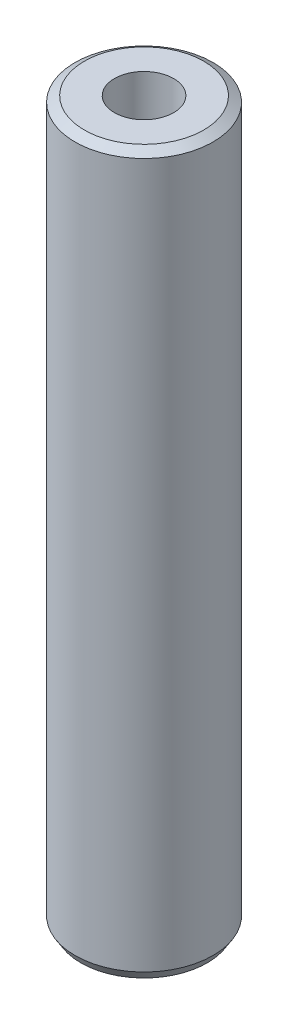
ISO-10303-21;
HEADER;
FILE_DESCRIPTION(('STEP AP214'),'2;1');
FILE_NAME('part.step','',(''),(''),'','','');
FILE_SCHEMA(('AUTOMOTIVE_DESIGN { 1 0 10303 214 1 1 1 1 }'));
ENDSEC;
DATA;
#1=APPLICATION_CONTEXT('core data for automotive mechanical design processes');
#2=APPLICATION_PROTOCOL_DEFINITION('international standard','automotive_design',2000,#1);
#3=PRODUCT_CONTEXT('',#1,'mechanical');
#4=PRODUCT('Part','Part','',(#3));
#5=PRODUCT_RELATED_PRODUCT_CATEGORY('part','',(#4));
#6=PRODUCT_DEFINITION_FORMATION('','',#4);
#7=PRODUCT_DEFINITION_CONTEXT('part definition',#1,'design');
#8=PRODUCT_DEFINITION('design','',#6,#7);
#9=PRODUCT_DEFINITION_SHAPE('','',#8);
#10=(LENGTH_UNIT() NAMED_UNIT(*) SI_UNIT(.MILLI.,.METRE.));
#11=(NAMED_UNIT(*) PLANE_ANGLE_UNIT() SI_UNIT($,.RADIAN.));
#12=(NAMED_UNIT(*) SI_UNIT($,.STERADIAN.) SOLID_ANGLE_UNIT());
#13=UNCERTAINTY_MEASURE_WITH_UNIT(LENGTH_MEASURE(1.E-05),#10,'distance_accuracy_value','');
#14=(GEOMETRIC_REPRESENTATION_CONTEXT(3) GLOBAL_UNCERTAINTY_ASSIGNED_CONTEXT((#13)) GLOBAL_UNIT_ASSIGNED_CONTEXT((#10,
#11,#12)) REPRESENTATION_CONTEXT('',''));
#15=CARTESIAN_POINT('',(0.,0.,0.));
#16=DIRECTION('',(0.,0.,1.));
#17=DIRECTION('',(1.,0.,0.));
#18=AXIS2_PLACEMENT_3D('',#15,#16,#17);
#19=CARTESIAN_POINT('',(0.,600.,0.));
#20=DIRECTION('',(0.,-1.,0.));
#21=DIRECTION('',(0.,0.,-1.));
#22=AXIS2_PLACEMENT_3D('',#19,#20,#21);
#23=CYLINDRICAL_SURFACE('',#22,57.5);
#24=CARTESIAN_POINT('',(0.,595.210824169814,0.));
#25=DIRECTION('',(0.,1.,0.));
#26=DIRECTION('',(0.,0.,1.));
#27=AXIS2_PLACEMENT_3D('',#24,#25,#26);
#28=CIRCLE('',#27,57.5);
#29=CARTESIAN_POINT('',(0.,595.210824169814,-57.5000000000001));
#30=VERTEX_POINT('',#29);
#31=EDGE_CURVE('E50',#30,#30,#28,.F.);
#32=ORIENTED_EDGE('',*,*,#31,.T.);
#33=EDGE_LOOP('',(#32));
#34=FACE_BOUND('',#33,.T.);
#35=CARTESIAN_POINT('',(0.,7.72489831246326,0.));
#36=DIRECTION('',(0.,1.,0.));
#37=DIRECTION('',(0.,0.,1.));
#38=AXIS2_PLACEMENT_3D('',#35,#36,#37);
#39=CIRCLE('',#38,57.5);
#40=CARTESIAN_POINT('',(0.,7.72489831246326,57.5));
#41=VERTEX_POINT('',#40);
#42=EDGE_CURVE('E51',#41,#41,#39,.T.);
#43=ORIENTED_EDGE('',*,*,#42,.T.);
#44=EDGE_LOOP('',(#43));
#45=FACE_BOUND('',#44,.T.);
#46=ADVANCED_FACE('F39',(#34,#45),#23,.T.);
#47=CARTESIAN_POINT('',(0.,600.,0.));
#48=DIRECTION('',(0.,1.,0.));
#49=DIRECTION('',(0.,0.,1.));
#50=AXIS2_PLACEMENT_3D('',#47,#48,#49);
#51=PLANE('',#50);
#52=CARTESIAN_POINT('',(0.,600.,0.));
#53=DIRECTION('',(0.,1.,0.));
#54=DIRECTION('',(0.,0.,1.));
#55=AXIS2_PLACEMENT_3D('',#52,#53,#54);
#56=CIRCLE('',#55,49.7751016875367);
#57=CARTESIAN_POINT('',(0.,600.,-49.7751016875368));
#58=VERTEX_POINT('',#57);
#59=EDGE_CURVE('E54',#58,#58,#56,.T.);
#60=ORIENTED_EDGE('',*,*,#59,.T.);
#61=EDGE_LOOP('',(#60));
#62=FACE_BOUND('',#61,.T.);
#63=CARTESIAN_POINT('',(0.,600.,0.));
#64=DIRECTION('',(0.,1.,0.));
#65=DIRECTION('',(0.,0.,1.));
#66=AXIS2_PLACEMENT_3D('',#63,#64,#65);
#67=CIRCLE('',#66,24.6803880786549);
#68=CARTESIAN_POINT('',(0.,600.,24.6803880786549));
#69=VERTEX_POINT('',#68);
#70=EDGE_CURVE('E58',#69,#69,#67,.T.);
#71=ORIENTED_EDGE('',*,*,#70,.F.);
#72=EDGE_LOOP('',(#71));
#73=FACE_BOUND('',#72,.T.);
#74=ADVANCED_FACE('F69',(#62,#73),#51,.T.);
#75=CARTESIAN_POINT('',(0.,0.,0.));
#76=DIRECTION('',(0.,1.,0.));
#77=DIRECTION('',(0.,0.,1.));
#78=AXIS2_PLACEMENT_3D('',#75,#76,#77);
#79=PLANE('',#78);
#80=CARTESIAN_POINT('',(0.,0.,0.));
#81=DIRECTION('',(0.,1.,0.));
#82=DIRECTION('',(0.,0.,1.));
#83=AXIS2_PLACEMENT_3D('',#80,#81,#82);
#84=CIRCLE('',#83,52.7108241698138);
#85=CARTESIAN_POINT('',(0.,0.,52.7108241698138));
#86=VERTEX_POINT('',#85);
#87=EDGE_CURVE('E10',#86,#86,#84,.F.);
#88=ORIENTED_EDGE('',*,*,#87,.T.);
#89=EDGE_LOOP('',(#88));
#90=FACE_BOUND('',#89,.T.);
#91=CARTESIAN_POINT('',(0.,0.,0.));
#92=DIRECTION('',(0.,1.,0.));
#93=DIRECTION('',(0.,0.,1.));
#94=AXIS2_PLACEMENT_3D('',#91,#92,#93);
#95=CIRCLE('',#94,24.6803880786549);
#96=CARTESIAN_POINT('',(0.,0.,24.6803880786549));
#97=VERTEX_POINT('',#96);
#98=EDGE_CURVE('E63',#97,#97,#95,.T.);
#99=ORIENTED_EDGE('',*,*,#98,.T.);
#100=EDGE_LOOP('',(#99));
#101=FACE_BOUND('',#100,.T.);
#102=ADVANCED_FACE('F75',(#90,#101),#79,.F.);
#103=CARTESIAN_POINT('',(0.,600.,0.));
#104=DIRECTION('',(0.,-1.,0.));
#105=DIRECTION('',(0.,0.,-1.));
#106=AXIS2_PLACEMENT_3D('',#103,#104,#105);
#107=CYLINDRICAL_SURFACE('',#106,24.6803880786549);
#108=ORIENTED_EDGE('',*,*,#70,.T.);
#109=EDGE_LOOP('',(#108));
#110=FACE_BOUND('',#109,.T.);
#111=ORIENTED_EDGE('',*,*,#98,.F.);
#112=EDGE_LOOP('',(#111));
#113=FACE_BOUND('',#112,.T.);
#114=ADVANCED_FACE('F70',(#110,#113),#107,.F.);
#115=CARTESIAN_POINT('',(0.,600.,0.));
#116=DIRECTION('',(0.,-1.,0.));
#117=DIRECTION('',(0.,0.,-1.));
#118=AXIS2_PLACEMENT_3D('',#115,#116,#117);
#119=CONICAL_SURFACE('',#118,49.7751016875367,1.01582501679004);
#120=CARTESIAN_POINT('',(0.,595.210824169814,-57.5000000000001));
#121=CARTESIAN_POINT('',(0.,595.260711418045,-57.4195323092453));
#122=CARTESIAN_POINT('',(0.,595.310598666276,-57.3390646184904));
#123=CARTESIAN_POINT('',(0.,595.410373162738,-57.1781292369808));
#124=CARTESIAN_POINT('',(0.,595.460260410969,-57.097661546226));
#125=CARTESIAN_POINT('',(0.,595.560034907431,-56.9367261647163));
#126=CARTESIAN_POINT('',(0.,595.609922155663,-56.8562584739615));
#127=CARTESIAN_POINT('',(0.,595.709696652125,-56.6953230924518));
#128=CARTESIAN_POINT('',(0.,595.759583900356,-56.614855401697));
#129=CARTESIAN_POINT('',(0.,595.859358396818,-56.4539200201874));
#130=CARTESIAN_POINT('',(0.,595.909245645049,-56.3734523294325));
#131=CARTESIAN_POINT('',(0.,596.009020141511,-56.2125169479229));
#132=CARTESIAN_POINT('',(0.,596.058907389743,-56.1320492571681));
#133=CARTESIAN_POINT('',(0.,596.158681886205,-55.9711138756584));
#134=CARTESIAN_POINT('',(0.,596.208569134436,-55.8906461849036));
#135=CARTESIAN_POINT('',(0.,596.308343630898,-55.7297108033939));
#136=CARTESIAN_POINT('',(0.,596.358230879129,-55.6492431126391));
#137=CARTESIAN_POINT('',(0.,596.458005375591,-55.4883077311295));
#138=CARTESIAN_POINT('',(0.,596.507892623822,-55.4078400403746));
#139=CARTESIAN_POINT('',(0.,596.607667120285,-55.246904658865));
#140=CARTESIAN_POINT('',(0.,596.657554368516,-55.1664369681102));
#141=CARTESIAN_POINT('',(0.,596.757328864978,-55.0055015866005));
#142=CARTESIAN_POINT('',(0.,596.807216113209,-54.9250338958457));
#143=CARTESIAN_POINT('',(0.,596.906990609671,-54.764098514336));
#144=CARTESIAN_POINT('',(0.,596.956877857902,-54.6836308235812));
#145=CARTESIAN_POINT('',(0.,597.056652354365,-54.5226954420716));
#146=CARTESIAN_POINT('',(0.,597.106539602596,-54.4422277513167));
#147=CARTESIAN_POINT('',(0.,597.206314099058,-54.2812923698071));
#148=CARTESIAN_POINT('',(0.,597.256201347289,-54.2008246790522));
#149=CARTESIAN_POINT('',(0.,597.355975843751,-54.0398892975426));
#150=CARTESIAN_POINT('',(0.,597.405863091982,-53.9594216067878));
#151=CARTESIAN_POINT('',(0.,597.505637588445,-53.7984862252781));
#152=CARTESIAN_POINT('',(0.,597.555524836676,-53.7180185345233));
#153=CARTESIAN_POINT('',(0.,597.655299333138,-53.5570831530136));
#154=CARTESIAN_POINT('',(0.,597.705186581369,-53.4766154622588));
#155=CARTESIAN_POINT('',(0.,597.804961077831,-53.3156800807492));
#156=CARTESIAN_POINT('',(0.,597.854848326062,-53.2352123899943));
#157=CARTESIAN_POINT('',(0.,597.954622822525,-53.0742770084847));
#158=CARTESIAN_POINT('',(0.,598.004510070756,-52.9938093177299));
#159=CARTESIAN_POINT('',(0.,598.104284567218,-52.8328739362202));
#160=CARTESIAN_POINT('',(0.,598.154171815449,-52.7524062454654));
#161=CARTESIAN_POINT('',(0.,598.253946311911,-52.5914708639557));
#162=CARTESIAN_POINT('',(0.,598.303833560142,-52.5110031732009));
#163=CARTESIAN_POINT('',(0.,598.403608056605,-52.3500677916913));
#164=CARTESIAN_POINT('',(0.,598.453495304836,-52.2696001009364));
#165=CARTESIAN_POINT('',(0.,598.553269801298,-52.1086647194268));
#166=CARTESIAN_POINT('',(0.,598.603157049529,-52.0281970286719));
#167=CARTESIAN_POINT('',(0.,598.702931545991,-51.8672616471623));
#168=CARTESIAN_POINT('',(0.,598.752818794222,-51.7867939564075));
#169=CARTESIAN_POINT('',(0.,598.852593290684,-51.6258585748978));
#170=CARTESIAN_POINT('',(0.,598.902480538916,-51.545390884143));
#171=CARTESIAN_POINT('',(0.,599.002255035378,-51.3844555026333));
#172=CARTESIAN_POINT('',(0.,599.052142283609,-51.3039878118785));
#173=CARTESIAN_POINT('',(0.,599.151916780071,-51.1430524303689));
#174=CARTESIAN_POINT('',(0.,599.201804028302,-51.062584739614));
#175=CARTESIAN_POINT('',(0.,599.301578524764,-50.9016493581044));
#176=CARTESIAN_POINT('',(0.,599.351465772996,-50.8211816673496));
#177=CARTESIAN_POINT('',(0.,599.451240269458,-50.6602462858399));
#178=CARTESIAN_POINT('',(0.,599.501127517689,-50.5797785950851));
#179=CARTESIAN_POINT('',(0.,599.600902014151,-50.4188432135754));
#180=CARTESIAN_POINT('',(0.,599.650789262382,-50.3383755228206));
#181=CARTESIAN_POINT('',(0.,599.750563758844,-50.177440141311));
#182=CARTESIAN_POINT('',(0.,599.800451007076,-50.0969724505561));
#183=CARTESIAN_POINT('',(0.,599.900225503538,-49.9360370690465));
#184=CARTESIAN_POINT('',(0.,599.950112751769,-49.8555693782916));
#185=CARTESIAN_POINT('',(0.,600.,-49.7751016875368));
#186=B_SPLINE_CURVE_WITH_KNOTS('',3,(#120,#121,#122,#123,#124,#125,#126,#127,#128,#129,#130,
#131,#132,#133,#134,#135,#136,#137,#138,#139,#140,#141,#142,#143,#144,#145,#146,#147,#148,#149,
#150,#151,#152,#153,#154,#155,#156,#157,#158,#159,#160,#161,#162,#163,#164,#165,#166,#167,#168,
#169,#170,#171,#172,#173,#174,#175,#176,#177,#178,#179,#180,#181,#182,#183,#184,#185),
.UNSPECIFIED.,.F.,.F.,(4,2,2,2,2,2,2,2,2,2,2,2,2,2,2,2,2,2,2,2,2,2,2,2,2,2,2,2,2,2,2,2,4),(0.,
0.284031831179849,0.568063662359703,0.852095493539552,1.13612732471941,1.42015915589926,
1.70419098707911,1.98822281825896,2.27225464943881,2.55628648061866,2.84031831179852,
3.12435014297831,3.40838197415816,3.69241380533802,3.97644563651786,4.26047746769772,
4.54450929887757,4.82854113005742,5.11257296123727,5.39660479241713,5.68063662359697,
5.96466845477683,6.24870028595663,6.53273211713647,6.81676394831633,7.10079577949618,
7.38482761067603,7.66885944185588,7.95289127303573,8.23692310421558,8.52095493539544,
8.80498676657529,9.08901859775514),.UNSPECIFIED.);
#187=EDGE_CURVE('BSEAM81',#30,#58,#186,.T.);
#188=ORIENTED_EDGE('',*,*,#31,.F.);
#189=ORIENTED_EDGE('',*,*,#59,.F.);
#190=ORIENTED_EDGE('',*,*,#187,.T.);
#191=ORIENTED_EDGE('',*,*,#187,.F.);
#192=EDGE_LOOP('',(#188,#190,#189,#191));
#193=FACE_BOUND('',#192,.T.);
#194=ADVANCED_FACE('F81',(#193),#119,.T.);
#195=CARTESIAN_POINT('',(0.,7.72489831246326,0.));
#196=DIRECTION('',(0.,1.,0.));
#197=DIRECTION('',(0.,0.,1.));
#198=AXIS2_PLACEMENT_3D('',#195,#196,#197);
#199=CONICAL_SURFACE('',#198,57.5,0.554971310004853);
#200=ORIENTED_EDGE('',*,*,#87,.F.);
#201=EDGE_LOOP('',(#200));
#202=FACE_BOUND('',#201,.T.);
#203=ORIENTED_EDGE('',*,*,#42,.F.);
#204=EDGE_LOOP('',(#203));
#205=FACE_BOUND('',#204,.T.);
#206=ADVANCED_FACE('F45',(#202,#205),#199,.T.);
#207=CLOSED_SHELL('',(#46,#74,#102,#114,#194,#206));
#208=MANIFOLD_SOLID_BREP('B2',#207);
#209=ADVANCED_BREP_SHAPE_REPRESENTATION('',(#18,#208),#14);
#210=SHAPE_DEFINITION_REPRESENTATION(#9,#209);
ENDSEC;
END-ISO-10303-21;
